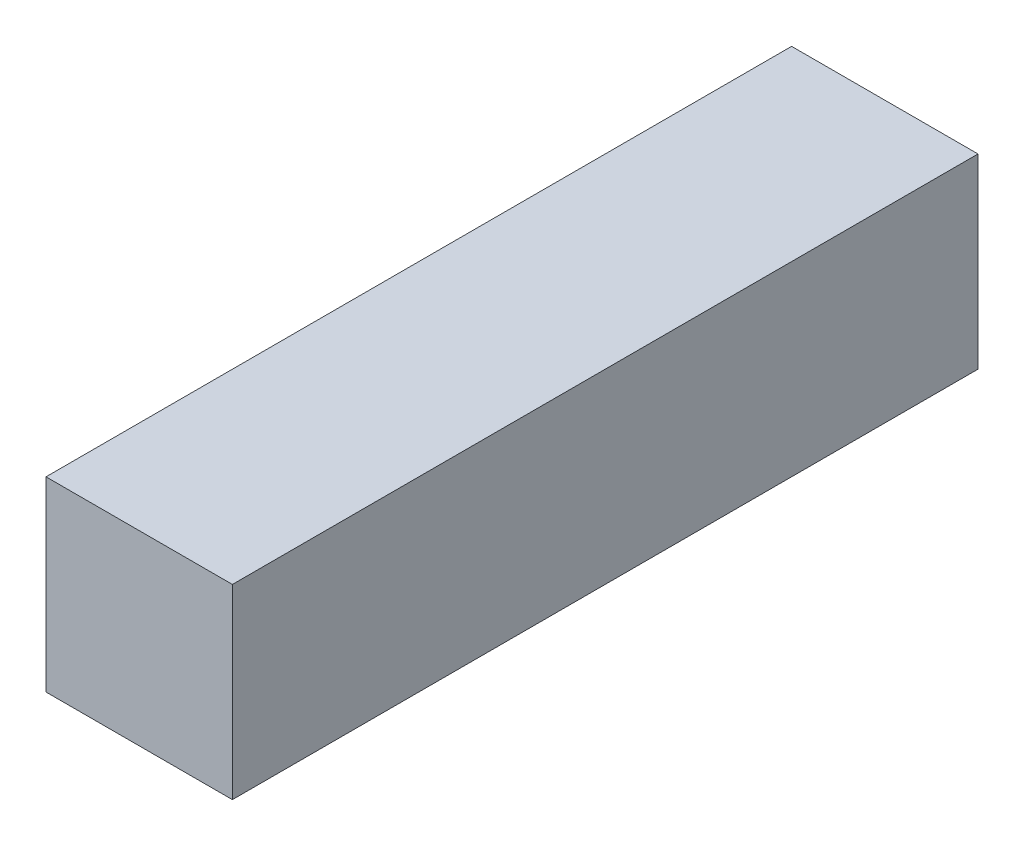
ISO-10303-21;
HEADER;
FILE_DESCRIPTION(('STEP AP214'),'2;1');
FILE_NAME('part.step','',(''),(''),'','','');
FILE_SCHEMA(('AUTOMOTIVE_DESIGN { 1 0 10303 214 1 1 1 1 }'));
ENDSEC;
DATA;
#1=APPLICATION_CONTEXT('core data for automotive mechanical design processes');
#2=APPLICATION_PROTOCOL_DEFINITION('international standard','automotive_design',2000,#1);
#3=PRODUCT_CONTEXT('',#1,'mechanical');
#4=PRODUCT('Part','Part','',(#3));
#5=PRODUCT_RELATED_PRODUCT_CATEGORY('part','',(#4));
#6=PRODUCT_DEFINITION_FORMATION('','',#4);
#7=PRODUCT_DEFINITION_CONTEXT('part definition',#1,'design');
#8=PRODUCT_DEFINITION('design','',#6,#7);
#9=PRODUCT_DEFINITION_SHAPE('','',#8);
#10=(LENGTH_UNIT() NAMED_UNIT(*) SI_UNIT(.MILLI.,.METRE.));
#11=(NAMED_UNIT(*) PLANE_ANGLE_UNIT() SI_UNIT($,.RADIAN.));
#12=(NAMED_UNIT(*) SI_UNIT($,.STERADIAN.) SOLID_ANGLE_UNIT());
#13=UNCERTAINTY_MEASURE_WITH_UNIT(LENGTH_MEASURE(1.E-05),#10,'distance_accuracy_value','');
#14=(GEOMETRIC_REPRESENTATION_CONTEXT(3) GLOBAL_UNCERTAINTY_ASSIGNED_CONTEXT((#13)) GLOBAL_UNIT_ASSIGNED_CONTEXT((#10,
#11,#12)) REPRESENTATION_CONTEXT('',''));
#15=CARTESIAN_POINT('',(0.,0.,0.));
#16=DIRECTION('',(0.,0.,1.));
#17=DIRECTION('',(1.,0.,0.));
#18=AXIS2_PLACEMENT_3D('',#15,#16,#17);
#19=CARTESIAN_POINT('',(-1.,2.,-8.));
#20=DIRECTION('',(0.,0.,1.));
#21=DIRECTION('',(1.,0.,0.));
#22=AXIS2_PLACEMENT_3D('',#19,#20,#21);
#23=PLANE('',#22);
#24=DIRECTION('',(-1.,0.,0.));
#25=VECTOR('',#24,1.);
#26=CARTESIAN_POINT('',(-1.,0.,-8.));
#27=LINE('',#26,#25);
#28=CARTESIAN_POINT('',(0.999999999999997,0.,-8.));
#29=VERTEX_POINT('',#28);
#30=CARTESIAN_POINT('',(-1.,0.,-8.));
#31=VERTEX_POINT('',#30);
#32=EDGE_CURVE('E113',#29,#31,#27,.T.);
#33=ORIENTED_EDGE('',*,*,#32,.T.);
#34=DIRECTION('',(0.,-1.,0.));
#35=VECTOR('',#34,1.);
#36=CARTESIAN_POINT('',(-1.,2.,-8.));
#37=LINE('',#36,#35);
#38=CARTESIAN_POINT('',(-1.,2.,-8.));
#39=VERTEX_POINT('',#38);
#40=EDGE_CURVE('E11',#39,#31,#37,.T.);
#41=ORIENTED_EDGE('',*,*,#40,.F.);
#42=DIRECTION('',(-1.,0.,0.));
#43=VECTOR('',#42,1.);
#44=CARTESIAN_POINT('',(-1.,2.,-8.));
#45=LINE('',#44,#43);
#46=CARTESIAN_POINT('',(0.999999999999997,2.,-8.));
#47=VERTEX_POINT('',#46);
#48=EDGE_CURVE('E97',#47,#39,#45,.T.);
#49=ORIENTED_EDGE('',*,*,#48,.F.);
#50=DIRECTION('',(0.,-1.,0.));
#51=VECTOR('',#50,1.);
#52=CARTESIAN_POINT('',(0.999999999999997,2.,-8.));
#53=LINE('',#52,#51);
#54=EDGE_CURVE('E109',#47,#29,#53,.T.);
#55=ORIENTED_EDGE('',*,*,#54,.T.);
#56=EDGE_LOOP('',(#33,#41,#49,#55));
#57=FACE_BOUND('',#56,.T.);
#58=ADVANCED_FACE('F45',(#57),#23,.F.);
#59=CARTESIAN_POINT('',(-1.,2.,0.));
#60=DIRECTION('',(1.,0.,0.));
#61=DIRECTION('',(0.,0.,-1.));
#62=AXIS2_PLACEMENT_3D('',#59,#60,#61);
#63=PLANE('',#62);
#64=DIRECTION('',(0.,0.,1.));
#65=VECTOR('',#64,1.);
#66=CARTESIAN_POINT('',(-1.,0.,0.));
#67=LINE('',#66,#65);
#68=CARTESIAN_POINT('',(-1.,0.,0.));
#69=VERTEX_POINT('',#68);
#70=EDGE_CURVE('E102',#31,#69,#67,.T.);
#71=ORIENTED_EDGE('',*,*,#70,.T.);
#72=DIRECTION('',(0.,-1.,0.));
#73=VECTOR('',#72,1.);
#74=CARTESIAN_POINT('',(-1.,2.,0.));
#75=LINE('',#74,#73);
#76=CARTESIAN_POINT('',(-1.,2.,0.));
#77=VERTEX_POINT('',#76);
#78=EDGE_CURVE('E54',#77,#69,#75,.T.);
#79=ORIENTED_EDGE('',*,*,#78,.F.);
#80=DIRECTION('',(0.,0.,1.));
#81=VECTOR('',#80,1.);
#82=CARTESIAN_POINT('',(-1.,2.,0.));
#83=LINE('',#82,#81);
#84=EDGE_CURVE('E92',#39,#77,#83,.T.);
#85=ORIENTED_EDGE('',*,*,#84,.F.);
#86=ORIENTED_EDGE('',*,*,#40,.T.);
#87=EDGE_LOOP('',(#71,#79,#85,#86));
#88=FACE_BOUND('',#87,.T.);
#89=ADVANCED_FACE('F101',(#88),#63,.F.);
#90=CARTESIAN_POINT('',(-1.,2.,0.));
#91=DIRECTION('',(0.,0.,-1.));
#92=DIRECTION('',(-1.,0.,0.));
#93=AXIS2_PLACEMENT_3D('',#90,#91,#92);
#94=PLANE('',#93);
#95=DIRECTION('',(1.,0.,0.));
#96=VECTOR('',#95,1.);
#97=CARTESIAN_POINT('',(-1.,0.,0.));
#98=LINE('',#97,#96);
#99=CARTESIAN_POINT('',(1.,0.,0.));
#100=VERTEX_POINT('',#99);
#101=EDGE_CURVE('E79',#69,#100,#98,.T.);
#102=ORIENTED_EDGE('',*,*,#101,.T.);
#103=DIRECTION('',(0.,-1.,0.));
#104=VECTOR('',#103,1.);
#105=CARTESIAN_POINT('',(1.,2.,0.));
#106=LINE('',#105,#104);
#107=CARTESIAN_POINT('',(1.,2.,0.));
#108=VERTEX_POINT('',#107);
#109=EDGE_CURVE('E104',#108,#100,#106,.T.);
#110=ORIENTED_EDGE('',*,*,#109,.F.);
#111=DIRECTION('',(1.,0.,0.));
#112=VECTOR('',#111,1.);
#113=CARTESIAN_POINT('',(-1.,2.,0.));
#114=LINE('',#113,#112);
#115=EDGE_CURVE('E95',#77,#108,#114,.T.);
#116=ORIENTED_EDGE('',*,*,#115,.F.);
#117=ORIENTED_EDGE('',*,*,#78,.T.);
#118=EDGE_LOOP('',(#102,#110,#116,#117));
#119=FACE_BOUND('',#118,.T.);
#120=ADVANCED_FACE('F105',(#119),#94,.F.);
#121=CARTESIAN_POINT('',(0.999999999999997,2.,-8.));
#122=DIRECTION('',(-1.,0.,0.));
#123=DIRECTION('',(0.,0.,1.));
#124=AXIS2_PLACEMENT_3D('',#121,#122,#123);
#125=PLANE('',#124);
#126=DIRECTION('',(0.,0.,-1.));
#127=VECTOR('',#126,1.);
#128=CARTESIAN_POINT('',(0.999999999999997,0.,-8.));
#129=LINE('',#128,#127);
#130=EDGE_CURVE('E85',#100,#29,#129,.T.);
#131=ORIENTED_EDGE('',*,*,#130,.T.);
#132=ORIENTED_EDGE('',*,*,#54,.F.);
#133=DIRECTION('',(0.,0.,-1.));
#134=VECTOR('',#133,1.);
#135=CARTESIAN_POINT('',(0.999999999999997,2.,-8.));
#136=LINE('',#135,#134);
#137=EDGE_CURVE('E62',#108,#47,#136,.T.);
#138=ORIENTED_EDGE('',*,*,#137,.F.);
#139=ORIENTED_EDGE('',*,*,#109,.T.);
#140=EDGE_LOOP('',(#131,#132,#138,#139));
#141=FACE_BOUND('',#140,.T.);
#142=ADVANCED_FACE('F126',(#141),#125,.F.);
#143=CARTESIAN_POINT('',(0.,2.,0.));
#144=DIRECTION('',(0.,-1.,0.));
#145=DIRECTION('',(0.,0.,-1.));
#146=AXIS2_PLACEMENT_3D('',#143,#144,#145);
#147=PLANE('',#146);
#148=ORIENTED_EDGE('',*,*,#48,.T.);
#149=ORIENTED_EDGE('',*,*,#84,.T.);
#150=ORIENTED_EDGE('',*,*,#115,.T.);
#151=ORIENTED_EDGE('',*,*,#137,.T.);
#152=EDGE_LOOP('',(#148,#149,#150,#151));
#153=FACE_BOUND('',#152,.T.);
#154=ADVANCED_FACE('F93',(#153),#147,.F.);
#155=CARTESIAN_POINT('',(0.,0.,0.));
#156=DIRECTION('',(0.,-1.,0.));
#157=DIRECTION('',(0.,0.,-1.));
#158=AXIS2_PLACEMENT_3D('',#155,#156,#157);
#159=PLANE('',#158);
#160=ORIENTED_EDGE('',*,*,#32,.F.);
#161=ORIENTED_EDGE('',*,*,#130,.F.);
#162=ORIENTED_EDGE('',*,*,#101,.F.);
#163=ORIENTED_EDGE('',*,*,#70,.F.);
#164=EDGE_LOOP('',(#160,#161,#162,#163));
#165=FACE_BOUND('',#164,.T.);
#166=ADVANCED_FACE('F129',(#165),#159,.T.);
#167=CLOSED_SHELL('',(#58,#89,#120,#142,#154,#166));
#168=MANIFOLD_SOLID_BREP('B2',#167);
#169=ADVANCED_BREP_SHAPE_REPRESENTATION('',(#18,#168),#14);
#170=SHAPE_DEFINITION_REPRESENTATION(#9,#169);
ENDSEC;
END-ISO-10303-21;
